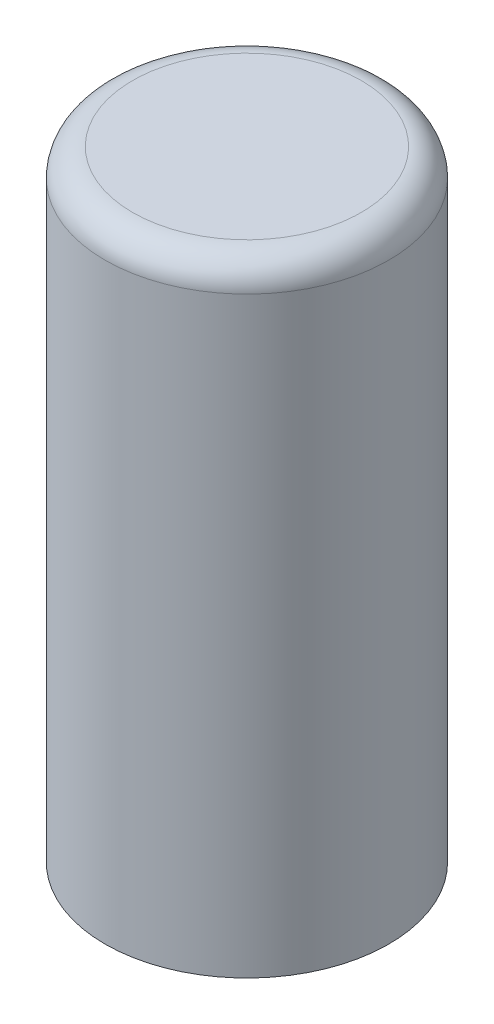
ISO-10303-21;
HEADER;
FILE_DESCRIPTION(('STEP AP214'),'2;1');
FILE_NAME('part.step','',(''),(''),'','','');
FILE_SCHEMA(('AUTOMOTIVE_DESIGN { 1 0 10303 214 1 1 1 1 }'));
ENDSEC;
DATA;
#1=APPLICATION_CONTEXT('core data for automotive mechanical design processes');
#2=APPLICATION_PROTOCOL_DEFINITION('international standard','automotive_design',2000,#1);
#3=PRODUCT_CONTEXT('',#1,'mechanical');
#4=PRODUCT('Part','Part','',(#3));
#5=PRODUCT_RELATED_PRODUCT_CATEGORY('part','',(#4));
#6=PRODUCT_DEFINITION_FORMATION('','',#4);
#7=PRODUCT_DEFINITION_CONTEXT('part definition',#1,'design');
#8=PRODUCT_DEFINITION('design','',#6,#7);
#9=PRODUCT_DEFINITION_SHAPE('','',#8);
#10=(LENGTH_UNIT() NAMED_UNIT(*) SI_UNIT(.MILLI.,.METRE.));
#11=(NAMED_UNIT(*) PLANE_ANGLE_UNIT() SI_UNIT($,.RADIAN.));
#12=(NAMED_UNIT(*) SI_UNIT($,.STERADIAN.) SOLID_ANGLE_UNIT());
#13=UNCERTAINTY_MEASURE_WITH_UNIT(LENGTH_MEASURE(1.E-05),#10,'distance_accuracy_value','');
#14=(GEOMETRIC_REPRESENTATION_CONTEXT(3) GLOBAL_UNCERTAINTY_ASSIGNED_CONTEXT((#13)) GLOBAL_UNIT_ASSIGNED_CONTEXT((#10,
#11,#12)) REPRESENTATION_CONTEXT('',''));
#15=CARTESIAN_POINT('',(0.,0.,0.));
#16=DIRECTION('',(0.,0.,1.));
#17=DIRECTION('',(1.,0.,0.));
#18=AXIS2_PLACEMENT_3D('',#15,#16,#17);
#19=CARTESIAN_POINT('',(3.46617379469,15.197980609798,-18.80208960352));
#20=DIRECTION('',(0.,1.,0.));
#21=DIRECTION('',(0.,0.,1.));
#22=AXIS2_PLACEMENT_3D('',#19,#20,#21);
#23=PLANE('',#22);
#24=CARTESIAN_POINT('',(3.46617379469,15.197980609798,-18.80208960352));
#25=DIRECTION('',(0.,-1.,0.));
#26=DIRECTION('',(0.,0.,-1.));
#27=AXIS2_PLACEMENT_3D('',#24,#25,#26);
#28=CIRCLE('',#27,2.075);
#29=CARTESIAN_POINT('',(3.46617379469,15.197980609798,-20.87708960352));
#30=VERTEX_POINT('',#29);
#31=CARTESIAN_POINT('',(3.46617379469,15.197980609798,-16.72708960352));
#32=VERTEX_POINT('',#31);
#33=EDGE_CURVE('E40',#30,#32,#28,.T.);
#34=ORIENTED_EDGE('',*,*,#33,.F.);
#35=CARTESIAN_POINT('',(3.46617379469,15.197980609798,-18.80208960352));
#36=DIRECTION('',(0.,-1.,0.));
#37=DIRECTION('',(0.,0.,1.));
#38=AXIS2_PLACEMENT_3D('',#35,#36,#37);
#39=CIRCLE('',#38,2.075);
#40=EDGE_CURVE('E34',#32,#30,#39,.T.);
#41=ORIENTED_EDGE('',*,*,#40,.F.);
#42=EDGE_LOOP('',(#34,#41));
#43=FACE_BOUND('',#42,.T.);
#44=ADVANCED_FACE('F17',(#43),#23,.T.);
#45=CARTESIAN_POINT('',(3.46617379469,14.697980609798,-18.80208960352));
#46=DIRECTION('',(0.,1.,0.));
#47=DIRECTION('',(0.,0.,1.));
#48=AXIS2_PLACEMENT_3D('',#45,#46,#47);
#49=TOROIDAL_SURFACE('',#48,2.075,0.5);
#50=ORIENTED_EDGE('',*,*,#40,.T.);
#51=ORIENTED_EDGE('',*,*,#33,.T.);
#52=EDGE_LOOP('',(#50,#51));
#53=FACE_BOUND('',#52,.T.);
#54=CARTESIAN_POINT('',(3.46617379469,14.697980609798,-18.80208960352));
#55=DIRECTION('',(0.,1.,0.));
#56=DIRECTION('',(0.,0.,1.));
#57=AXIS2_PLACEMENT_3D('',#54,#55,#56);
#58=CIRCLE('',#57,2.575);
#59=CARTESIAN_POINT('',(3.46617379469,14.697980609798,-16.22708960352));
#60=VERTEX_POINT('',#59);
#61=EDGE_CURVE('E27',#60,#60,#58,.F.);
#62=ORIENTED_EDGE('',*,*,#61,.F.);
#63=EDGE_LOOP('',(#62));
#64=FACE_BOUND('',#63,.T.);
#65=ADVANCED_FACE('F38',(#53,#64),#49,.T.);
#66=CARTESIAN_POINT('',(3.46617379469,3.947980609798,-18.80208960352));
#67=DIRECTION('',(0.,1.,0.));
#68=DIRECTION('',(0.,0.,1.));
#69=AXIS2_PLACEMENT_3D('',#66,#67,#68);
#70=PLANE('',#69);
#71=CARTESIAN_POINT('',(3.46617379469,3.947980609798,-18.80208960352));
#72=DIRECTION('',(0.,1.,0.));
#73=DIRECTION('',(0.,0.,1.));
#74=AXIS2_PLACEMENT_3D('',#71,#72,#73);
#75=CIRCLE('',#74,2.575);
#76=CARTESIAN_POINT('',(3.46617379469,3.947980609798,-16.22708960352));
#77=VERTEX_POINT('',#76);
#78=EDGE_CURVE('E11',#77,#77,#75,.T.);
#79=ORIENTED_EDGE('',*,*,#78,.F.);
#80=EDGE_LOOP('',(#79));
#81=FACE_BOUND('',#80,.T.);
#82=ADVANCED_FACE('F73',(#81),#70,.F.);
#83=CARTESIAN_POINT('',(3.46617379469,15.197980609798,-18.80208960352));
#84=DIRECTION('',(0.,1.,0.));
#85=DIRECTION('',(0.,0.,1.));
#86=AXIS2_PLACEMENT_3D('',#83,#84,#85);
#87=CYLINDRICAL_SURFACE('',#86,2.575);
#88=ORIENTED_EDGE('',*,*,#78,.T.);
#89=EDGE_LOOP('',(#88));
#90=FACE_BOUND('',#89,.T.);
#91=ORIENTED_EDGE('',*,*,#61,.T.);
#92=EDGE_LOOP('',(#91));
#93=FACE_BOUND('',#92,.T.);
#94=ADVANCED_FACE('F77',(#90,#93),#87,.T.);
#95=CLOSED_SHELL('',(#44,#65,#82,#94));
#96=MANIFOLD_SOLID_BREP('B1',#95);
#97=ADVANCED_BREP_SHAPE_REPRESENTATION('',(#18,#96),#14);
#98=SHAPE_DEFINITION_REPRESENTATION(#9,#97);
ENDSEC;
END-ISO-10303-21;
